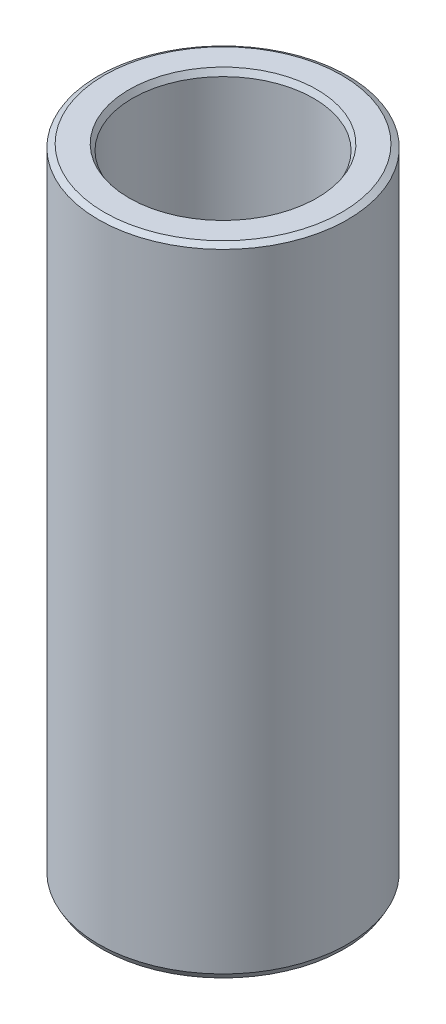
ISO-10303-21;
HEADER;
FILE_DESCRIPTION(('STEP AP214'),'2;1');
FILE_NAME('part.step','',(''),(''),'','','');
FILE_SCHEMA(('AUTOMOTIVE_DESIGN { 1 0 10303 214 1 1 1 1 }'));
ENDSEC;
DATA;
#1=APPLICATION_CONTEXT('core data for automotive mechanical design processes');
#2=APPLICATION_PROTOCOL_DEFINITION('international standard','automotive_design',2000,#1);
#3=PRODUCT_CONTEXT('',#1,'mechanical');
#4=PRODUCT('Part','Part','',(#3));
#5=PRODUCT_RELATED_PRODUCT_CATEGORY('part','',(#4));
#6=PRODUCT_DEFINITION_FORMATION('','',#4);
#7=PRODUCT_DEFINITION_CONTEXT('part definition',#1,'design');
#8=PRODUCT_DEFINITION('design','',#6,#7);
#9=PRODUCT_DEFINITION_SHAPE('','',#8);
#10=(LENGTH_UNIT() NAMED_UNIT(*) SI_UNIT(.MILLI.,.METRE.));
#11=(NAMED_UNIT(*) PLANE_ANGLE_UNIT() SI_UNIT($,.RADIAN.));
#12=(NAMED_UNIT(*) SI_UNIT($,.STERADIAN.) SOLID_ANGLE_UNIT());
#13=UNCERTAINTY_MEASURE_WITH_UNIT(LENGTH_MEASURE(1.E-05),#10,'distance_accuracy_value','');
#14=(GEOMETRIC_REPRESENTATION_CONTEXT(3) GLOBAL_UNCERTAINTY_ASSIGNED_CONTEXT((#13)) GLOBAL_UNIT_ASSIGNED_CONTEXT((#10,
#11,#12)) REPRESENTATION_CONTEXT('',''));
#15=CARTESIAN_POINT('',(0.,0.,0.));
#16=DIRECTION('',(0.,0.,1.));
#17=DIRECTION('',(1.,0.,0.));
#18=AXIS2_PLACEMENT_3D('',#15,#16,#17);
#19=CARTESIAN_POINT('',(0.,306.56805954563,0.));
#20=DIRECTION('',(0.,-1.,0.));
#21=DIRECTION('',(0.,0.,-1.));
#22=AXIS2_PLACEMENT_3D('',#19,#20,#21);
#23=CYLINDRICAL_SURFACE('',#22,60.);
#24=CARTESIAN_POINT('',(0.,2.8232350246632,0.));
#25=DIRECTION('',(0.,1.,0.));
#26=DIRECTION('',(0.,0.,1.));
#27=AXIS2_PLACEMENT_3D('',#24,#25,#26);
#28=CIRCLE('',#27,60.);
#29=CARTESIAN_POINT('',(0.,2.8232350246632,60.));
#30=VERTEX_POINT('',#29);
#31=EDGE_CURVE('E10',#30,#30,#28,.T.);
#32=ORIENTED_EDGE('',*,*,#31,.T.);
#33=EDGE_LOOP('',(#32));
#34=FACE_BOUND('',#33,.T.);
#35=CARTESIAN_POINT('',(0.,304.938064044156,0.));
#36=DIRECTION('',(0.,1.,0.));
#37=DIRECTION('',(0.,0.,1.));
#38=AXIS2_PLACEMENT_3D('',#35,#36,#37);
#39=CIRCLE('',#38,60.);
#40=CARTESIAN_POINT('',(0.,304.938064044156,60.));
#41=VERTEX_POINT('',#40);
#42=EDGE_CURVE('E50',#41,#41,#39,.F.);
#43=ORIENTED_EDGE('',*,*,#42,.T.);
#44=EDGE_LOOP('',(#43));
#45=FACE_BOUND('',#44,.T.);
#46=ADVANCED_FACE('F39',(#34,#45),#23,.T.);
#47=CARTESIAN_POINT('',(0.,306.56805954563,0.));
#48=DIRECTION('',(0.,1.,0.));
#49=DIRECTION('',(0.,0.,1.));
#50=AXIS2_PLACEMENT_3D('',#47,#48,#49);
#51=PLANE('',#50);
#52=CARTESIAN_POINT('',(0.,306.56805954563,0.));
#53=DIRECTION('',(0.,1.,0.));
#54=DIRECTION('',(0.,0.,1.));
#55=AXIS2_PLACEMENT_3D('',#52,#53,#54);
#56=CIRCLE('',#55,45.2349582671162);
#57=CARTESIAN_POINT('',(0.,306.56805954563,45.2349582671162));
#58=VERTEX_POINT('',#57);
#59=EDGE_CURVE('E58',#58,#58,#56,.F.);
#60=ORIENTED_EDGE('',*,*,#59,.T.);
#61=EDGE_LOOP('',(#60));
#62=FACE_BOUND('',#61,.T.);
#63=CARTESIAN_POINT('',(0.,306.56805954563,0.));
#64=DIRECTION('',(0.,1.,0.));
#65=DIRECTION('',(0.,0.,1.));
#66=AXIS2_PLACEMENT_3D('',#63,#64,#65);
#67=CIRCLE('',#66,57.1767649753369);
#68=CARTESIAN_POINT('',(0.,306.56805954563,57.1767649753369));
#69=VERTEX_POINT('',#68);
#70=EDGE_CURVE('E61',#69,#69,#67,.T.);
#71=ORIENTED_EDGE('',*,*,#70,.T.);
#72=EDGE_LOOP('',(#71));
#73=FACE_BOUND('',#72,.T.);
#74=ADVANCED_FACE('F88',(#62,#73),#51,.T.);
#75=CARTESIAN_POINT('',(0.,0.,0.));
#76=DIRECTION('',(0.,1.,0.));
#77=DIRECTION('',(0.,0.,1.));
#78=AXIS2_PLACEMENT_3D('',#75,#76,#77);
#79=PLANE('',#78);
#80=CARTESIAN_POINT('',(0.,0.,0.));
#81=DIRECTION('',(0.,1.,0.));
#82=DIRECTION('',(0.,0.,1.));
#83=AXIS2_PLACEMENT_3D('',#80,#81,#82);
#84=CIRCLE('',#83,46.4281977903045);
#85=CARTESIAN_POINT('',(0.,0.,46.4281977903045));
#86=VERTEX_POINT('',#85);
#87=EDGE_CURVE('E51',#86,#86,#84,.T.);
#88=ORIENTED_EDGE('',*,*,#87,.T.);
#89=EDGE_LOOP('',(#88));
#90=FACE_BOUND('',#89,.T.);
#91=CARTESIAN_POINT('',(0.,0.,0.));
#92=DIRECTION('',(0.,1.,0.));
#93=DIRECTION('',(0.,0.,1.));
#94=AXIS2_PLACEMENT_3D('',#91,#92,#93);
#95=CIRCLE('',#94,58.3700044985251);
#96=CARTESIAN_POINT('',(0.,0.,58.3700044985251));
#97=VERTEX_POINT('',#96);
#98=EDGE_CURVE('E54',#97,#97,#95,.F.);
#99=ORIENTED_EDGE('',*,*,#98,.T.);
#100=EDGE_LOOP('',(#99));
#101=FACE_BOUND('',#100,.T.);
#102=ADVANCED_FACE('F83',(#90,#101),#79,.F.);
#103=CARTESIAN_POINT('',(0.,306.56805954563,0.));
#104=DIRECTION('',(0.,-1.,0.));
#105=DIRECTION('',(0.,0.,-1.));
#106=AXIS2_PLACEMENT_3D('',#103,#104,#105);
#107=CYLINDRICAL_SURFACE('',#106,43.6049627656413);
#108=CARTESIAN_POINT('',(0.,303.744824520967,0.));
#109=DIRECTION('',(0.,1.,0.));
#110=DIRECTION('',(0.,0.,1.));
#111=AXIS2_PLACEMENT_3D('',#108,#109,#110);
#112=CIRCLE('',#111,43.6049627656413);
#113=CARTESIAN_POINT('',(0.,303.744824520967,43.6049627656413));
#114=VERTEX_POINT('',#113);
#115=EDGE_CURVE('E67',#114,#114,#112,.T.);
#116=ORIENTED_EDGE('',*,*,#115,.T.);
#117=EDGE_LOOP('',(#116));
#118=FACE_BOUND('',#117,.T.);
#119=CARTESIAN_POINT('',(0.,1.62999550147486,0.));
#120=DIRECTION('',(0.,1.,0.));
#121=DIRECTION('',(0.,0.,1.));
#122=AXIS2_PLACEMENT_3D('',#119,#120,#121);
#123=CIRCLE('',#122,43.6049627656413);
#124=CARTESIAN_POINT('',(0.,1.62999550147486,43.6049627656413));
#125=VERTEX_POINT('',#124);
#126=EDGE_CURVE('E69',#125,#125,#123,.F.);
#127=ORIENTED_EDGE('',*,*,#126,.T.);
#128=EDGE_LOOP('',(#127));
#129=FACE_BOUND('',#128,.T.);
#130=ADVANCED_FACE('F71',(#118,#129),#107,.F.);
#131=CARTESIAN_POINT('',(0.,303.744824520967,0.));
#132=DIRECTION('',(0.,1.,0.));
#133=DIRECTION('',(0.,0.,1.));
#134=AXIS2_PLACEMENT_3D('',#131,#132,#133);
#135=CONICAL_SURFACE('',#134,43.6049627656413,0.523598775598304);
#136=CARTESIAN_POINT('',(0.,306.56805954563,45.2349582671162));
#137=CARTESIAN_POINT('',(0.,306.538650847457,45.2179791473091));
#138=CARTESIAN_POINT('',(0.,306.509242149283,45.2010000275021));
#139=CARTESIAN_POINT('',(0.,306.450424752936,45.1670417878881));
#140=CARTESIAN_POINT('',(0.,306.421016054763,45.150062668081));
#141=CARTESIAN_POINT('',(0.,306.362198658415,45.116104428467));
#142=CARTESIAN_POINT('',(0.,306.332789960242,45.0991253086599));
#143=CARTESIAN_POINT('',(0.,306.273972563895,45.0651670690459));
#144=CARTESIAN_POINT('',(0.,306.244563865721,45.0481879492388));
#145=CARTESIAN_POINT('',(0.,306.185746469374,45.0142297096248));
#146=CARTESIAN_POINT('',(0.,306.1563377712,44.9972505898177));
#147=CARTESIAN_POINT('',(0.,306.097520374853,44.9632923502037));
#148=CARTESIAN_POINT('',(0.,306.06811167668,44.9463132303967));
#149=CARTESIAN_POINT('',(0.,306.009294280332,44.9123549907826));
#150=CARTESIAN_POINT('',(0.,305.979885582159,44.8953758709756));
#151=CARTESIAN_POINT('',(0.,305.921068185812,44.8614176313615));
#152=CARTESIAN_POINT('',(0.,305.891659487638,44.8444385115545));
#153=CARTESIAN_POINT('',(0.,305.832842091291,44.8104802719404));
#154=CARTESIAN_POINT('',(0.,305.803433393117,44.7935011521334));
#155=CARTESIAN_POINT('',(0.,305.74461599677,44.7595429125193));
#156=CARTESIAN_POINT('',(0.,305.715207298597,44.7425637927123));
#157=CARTESIAN_POINT('',(0.,305.65638990225,44.7086055530982));
#158=CARTESIAN_POINT('',(0.,305.626981204076,44.6916264332912));
#159=CARTESIAN_POINT('',(0.,305.568163807729,44.6576681936771));
#160=CARTESIAN_POINT('',(0.,305.538755109555,44.6406890738701));
#161=CARTESIAN_POINT('',(0.,305.479937713208,44.6067308342561));
#162=CARTESIAN_POINT('',(0.,305.450529015035,44.589751714449));
#163=CARTESIAN_POINT('',(0.,305.391711618687,44.555793474835));
#164=CARTESIAN_POINT('',(0.,305.362302920514,44.5388143550279));
#165=CARTESIAN_POINT('',(0.,305.303485524167,44.5048561154139));
#166=CARTESIAN_POINT('',(0.,305.274076825993,44.4878769956068));
#167=CARTESIAN_POINT('',(0.,305.215259429646,44.4539187559928));
#168=CARTESIAN_POINT('',(0.,305.185850731472,44.4369396361858));
#169=CARTESIAN_POINT('',(0.,305.127033335125,44.4029813965717));
#170=CARTESIAN_POINT('',(0.,305.097624636952,44.3860022767647));
#171=CARTESIAN_POINT('',(0.,305.038807240605,44.3520440371506));
#172=CARTESIAN_POINT('',(0.,305.009398542431,44.3350649173436));
#173=CARTESIAN_POINT('',(0.,304.950581146084,44.3011066777295));
#174=CARTESIAN_POINT('',(0.,304.92117244791,44.2841275579225));
#175=CARTESIAN_POINT('',(0.,304.862355051563,44.2501693183084));
#176=CARTESIAN_POINT('',(0.,304.83294635339,44.2331901985014));
#177=CARTESIAN_POINT('',(0.,304.774128957042,44.1992319588873));
#178=CARTESIAN_POINT('',(0.,304.744720258869,44.1822528390803));
#179=CARTESIAN_POINT('',(0.,304.685902862522,44.1482945994663));
#180=CARTESIAN_POINT('',(0.,304.656494164348,44.1313154796592));
#181=CARTESIAN_POINT('',(0.,304.597676768001,44.0973572400452));
#182=CARTESIAN_POINT('',(0.,304.568268069827,44.0803781202381));
#183=CARTESIAN_POINT('',(0.,304.50945067348,44.0464198806241));
#184=CARTESIAN_POINT('',(0.,304.480041975307,44.029440760817));
#185=CARTESIAN_POINT('',(0.,304.421224578959,43.995482521203));
#186=CARTESIAN_POINT('',(0.,304.391815880786,43.978503401396));
#187=CARTESIAN_POINT('',(0.,304.332998484439,43.9445451617819));
#188=CARTESIAN_POINT('',(0.,304.303589786265,43.9275660419749));
#189=CARTESIAN_POINT('',(0.,304.244772389918,43.8936078023608));
#190=CARTESIAN_POINT('',(0.,304.215363691744,43.8766286825538));
#191=CARTESIAN_POINT('',(0.,304.156546295397,43.8426704429397));
#192=CARTESIAN_POINT('',(0.,304.127137597224,43.8256913231327));
#193=CARTESIAN_POINT('',(0.,304.068320200877,43.7917330835186));
#194=CARTESIAN_POINT('',(0.,304.038911502703,43.7747539637116));
#195=CARTESIAN_POINT('',(0.,303.980094106356,43.7407957240975));
#196=CARTESIAN_POINT('',(0.,303.950685408182,43.7238166042905));
#197=CARTESIAN_POINT('',(0.,303.891868011835,43.6898583646764));
#198=CARTESIAN_POINT('',(0.,303.862459313662,43.6728792448694));
#199=CARTESIAN_POINT('',(0.,303.803641917314,43.6389210052554));
#200=CARTESIAN_POINT('',(0.,303.774233219141,43.6219418854483));
#201=CARTESIAN_POINT('',(0.,303.744824520967,43.6049627656413));
#202=B_SPLINE_CURVE_WITH_KNOTS('',3,(#136,#137,#138,#139,#140,#141,#142,#143,#144,#145,#146,
#147,#148,#149,#150,#151,#152,#153,#154,#155,#156,#157,#158,#159,#160,#161,#162,#163,#164,#165,
#166,#167,#168,#169,#170,#171,#172,#173,#174,#175,#176,#177,#178,#179,#180,#181,#182,#183,#184,
#185,#186,#187,#188,#189,#190,#191,#192,#193,#194,#195,#196,#197,#198,#199,#200,#201),
.UNSPECIFIED.,.F.,.F.,(4,2,2,2,2,2,2,2,2,2,2,2,2,2,2,2,2,2,2,2,2,2,2,2,2,2,2,2,2,2,2,2,4),(0.,
0.101874718842201,0.203749437684403,0.305624156526556,0.407498875368754,0.509373594210907,
0.611248313053108,0.713123031895262,0.81499775073746,0.916872469579613,1.01874718842181,
1.12062190726397,1.22249662610617,1.32437134494832,1.42624606379052,1.52812078263267,
1.62999550147487,1.73187022031708,1.83374493915923,1.93561965800143,2.03749437684358,
2.13936909568578,2.24124381452793,2.34311853337013,2.44499325221229,2.54686797105449,
2.64874268989664,2.75061740873884,2.85249212758099,2.95436684642319,3.05624156526535,
3.15811628410755,3.2599910029497),.UNSPECIFIED.);
#203=EDGE_CURVE('BSEAM77',#58,#114,#202,.T.);
#204=ORIENTED_EDGE('',*,*,#59,.F.);
#205=ORIENTED_EDGE('',*,*,#115,.F.);
#206=ORIENTED_EDGE('',*,*,#203,.T.);
#207=ORIENTED_EDGE('',*,*,#203,.F.);
#208=EDGE_LOOP('',(#204,#206,#205,#207));
#209=FACE_BOUND('',#208,.T.);
#210=ADVANCED_FACE('F77',(#209),#135,.F.);
#211=CARTESIAN_POINT('',(0.,0.,0.));
#212=DIRECTION('',(0.,-1.,0.));
#213=DIRECTION('',(0.,0.,-1.));
#214=AXIS2_PLACEMENT_3D('',#211,#212,#213);
#215=CONICAL_SURFACE('',#214,46.4281977903045,1.0471975511966);
#216=ORIENTED_EDGE('',*,*,#126,.F.);
#217=EDGE_LOOP('',(#216));
#218=FACE_BOUND('',#217,.T.);
#219=ORIENTED_EDGE('',*,*,#87,.F.);
#220=EDGE_LOOP('',(#219));
#221=FACE_BOUND('',#220,.T.);
#222=ADVANCED_FACE('F73',(#218,#221),#215,.F.);
#223=CARTESIAN_POINT('',(0.,2.8232350246632,0.));
#224=DIRECTION('',(0.,1.,0.));
#225=DIRECTION('',(0.,0.,1.));
#226=AXIS2_PLACEMENT_3D('',#223,#224,#225);
#227=CONICAL_SURFACE('',#226,60.,0.523598775598305);
#228=ORIENTED_EDGE('',*,*,#98,.F.);
#229=EDGE_LOOP('',(#228));
#230=FACE_BOUND('',#229,.T.);
#231=ORIENTED_EDGE('',*,*,#31,.F.);
#232=EDGE_LOOP('',(#231));
#233=FACE_BOUND('',#232,.T.);
#234=ADVANCED_FACE('F76',(#230,#233),#227,.T.);
#235=CARTESIAN_POINT('',(0.,306.56805954563,0.));
#236=DIRECTION('',(0.,-1.,0.));
#237=DIRECTION('',(0.,0.,-1.));
#238=AXIS2_PLACEMENT_3D('',#235,#236,#237);
#239=CONICAL_SURFACE('',#238,57.1767649753369,1.04719755119659);
#240=ORIENTED_EDGE('',*,*,#42,.F.);
#241=EDGE_LOOP('',(#240));
#242=FACE_BOUND('',#241,.T.);
#243=ORIENTED_EDGE('',*,*,#70,.F.);
#244=EDGE_LOOP('',(#243));
#245=FACE_BOUND('',#244,.T.);
#246=ADVANCED_FACE('F45',(#242,#245),#239,.T.);
#247=CLOSED_SHELL('',(#46,#74,#102,#130,#210,#222,#234,#246));
#248=MANIFOLD_SOLID_BREP('B2',#247);
#249=ADVANCED_BREP_SHAPE_REPRESENTATION('',(#18,#248),#14);
#250=SHAPE_DEFINITION_REPRESENTATION(#9,#249);
ENDSEC;
END-ISO-10303-21;
